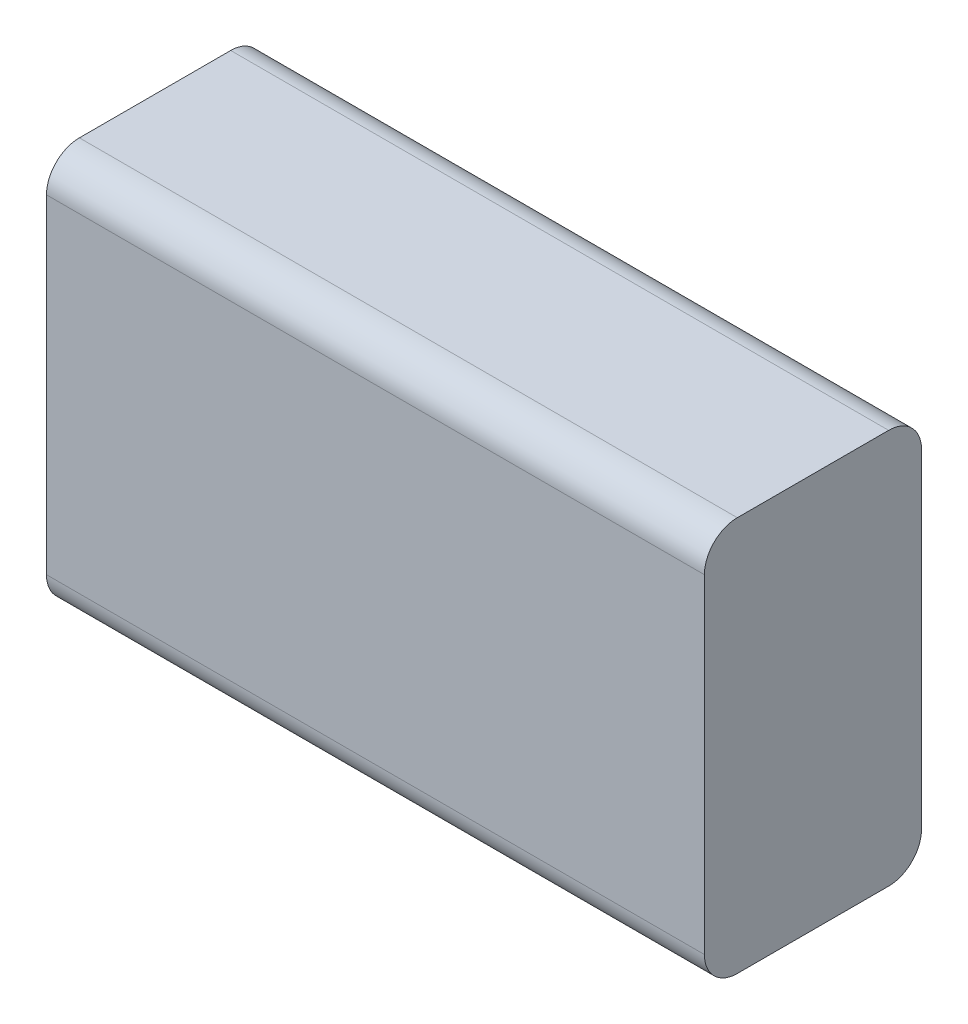
ISO-10303-21;
HEADER;
FILE_DESCRIPTION(('STEP AP214'),'2;1');
FILE_NAME('part.step','',(''),(''),'','','');
FILE_SCHEMA(('AUTOMOTIVE_DESIGN { 1 0 10303 214 1 1 1 1 }'));
ENDSEC;
DATA;
#1=APPLICATION_CONTEXT('core data for automotive mechanical design processes');
#2=APPLICATION_PROTOCOL_DEFINITION('international standard','automotive_design',2000,#1);
#3=PRODUCT_CONTEXT('',#1,'mechanical');
#4=PRODUCT('Part','Part','',(#3));
#5=PRODUCT_RELATED_PRODUCT_CATEGORY('part','',(#4));
#6=PRODUCT_DEFINITION_FORMATION('','',#4);
#7=PRODUCT_DEFINITION_CONTEXT('part definition',#1,'design');
#8=PRODUCT_DEFINITION('design','',#6,#7);
#9=PRODUCT_DEFINITION_SHAPE('','',#8);
#10=(LENGTH_UNIT() NAMED_UNIT(*) SI_UNIT(.MILLI.,.METRE.));
#11=(NAMED_UNIT(*) PLANE_ANGLE_UNIT() SI_UNIT($,.RADIAN.));
#12=(NAMED_UNIT(*) SI_UNIT($,.STERADIAN.) SOLID_ANGLE_UNIT());
#13=UNCERTAINTY_MEASURE_WITH_UNIT(LENGTH_MEASURE(1.E-05),#10,'distance_accuracy_value','');
#14=(GEOMETRIC_REPRESENTATION_CONTEXT(3) GLOBAL_UNCERTAINTY_ASSIGNED_CONTEXT((#13)) GLOBAL_UNIT_ASSIGNED_CONTEXT((#10,
#11,#12)) REPRESENTATION_CONTEXT('',''));
#15=CARTESIAN_POINT('',(0.,0.,0.));
#16=DIRECTION('',(0.,0.,1.));
#17=DIRECTION('',(1.,0.,0.));
#18=AXIS2_PLACEMENT_3D('',#15,#16,#17);
#19=CARTESIAN_POINT('',(0.,0.6,0.));
#20=DIRECTION('',(1.,0.,0.));
#21=DIRECTION('',(0.,0.,-1.));
#22=AXIS2_PLACEMENT_3D('',#19,#20,#21);
#23=PLANE('',#22);
#24=DIRECTION('',(0.,-1.,0.));
#25=VECTOR('',#24,1.);
#26=CARTESIAN_POINT('',(0.,0.6,0.33));
#27=LINE('',#26,#25);
#28=CARTESIAN_POINT('',(0.,0.55,0.33));
#29=VERTEX_POINT('',#28);
#30=CARTESIAN_POINT('',(0.,0.05,0.33));
#31=VERTEX_POINT('',#30);
#32=EDGE_CURVE('E126',#29,#31,#27,.T.);
#33=ORIENTED_EDGE('',*,*,#32,.F.);
#34=CARTESIAN_POINT('',(0.,0.55,0.28));
#35=DIRECTION('',(1.,0.,0.));
#36=DIRECTION('',(0.,0.,-1.));
#37=AXIS2_PLACEMENT_3D('',#34,#35,#36);
#38=CIRCLE('',#37,0.05);
#39=CARTESIAN_POINT('',(0.,0.6,0.28));
#40=VERTEX_POINT('',#39);
#41=EDGE_CURVE('E130',#29,#40,#38,.F.);
#42=ORIENTED_EDGE('',*,*,#41,.T.);
#43=DIRECTION('',(0.,0.,1.));
#44=VECTOR('',#43,1.);
#45=CARTESIAN_POINT('',(0.,0.6,0.));
#46=LINE('',#45,#44);
#47=CARTESIAN_POINT('',(0.,0.6,0.05));
#48=VERTEX_POINT('',#47);
#49=EDGE_CURVE('E120',#48,#40,#46,.T.);
#50=ORIENTED_EDGE('',*,*,#49,.F.);
#51=CARTESIAN_POINT('',(0.,0.55,0.05));
#52=DIRECTION('',(1.,0.,0.));
#53=DIRECTION('',(0.,0.,-1.));
#54=AXIS2_PLACEMENT_3D('',#51,#52,#53);
#55=CIRCLE('',#54,0.05);
#56=CARTESIAN_POINT('',(0.,0.55,0.));
#57=VERTEX_POINT('',#56);
#58=EDGE_CURVE('E65',#48,#57,#55,.F.);
#59=ORIENTED_EDGE('',*,*,#58,.T.);
#60=DIRECTION('',(0.,-1.,0.));
#61=VECTOR('',#60,1.);
#62=CARTESIAN_POINT('',(0.,0.6,0.));
#63=LINE('',#62,#61);
#64=CARTESIAN_POINT('',(0.,0.05,0.));
#65=VERTEX_POINT('',#64);
#66=EDGE_CURVE('E136',#57,#65,#63,.T.);
#67=ORIENTED_EDGE('',*,*,#66,.T.);
#68=CARTESIAN_POINT('',(0.,0.05,0.05));
#69=DIRECTION('',(1.,0.,0.));
#70=DIRECTION('',(0.,0.,-1.));
#71=AXIS2_PLACEMENT_3D('',#68,#69,#70);
#72=CIRCLE('',#71,0.05);
#73=CARTESIAN_POINT('',(0.,0.,0.05));
#74=VERTEX_POINT('',#73);
#75=EDGE_CURVE('E58',#65,#74,#72,.F.);
#76=ORIENTED_EDGE('',*,*,#75,.T.);
#77=DIRECTION('',(0.,0.,1.));
#78=VECTOR('',#77,1.);
#79=CARTESIAN_POINT('',(0.,0.,0.));
#80=LINE('',#79,#78);
#81=CARTESIAN_POINT('',(0.,0.,0.28));
#82=VERTEX_POINT('',#81);
#83=EDGE_CURVE('E139',#74,#82,#80,.T.);
#84=ORIENTED_EDGE('',*,*,#83,.T.);
#85=CARTESIAN_POINT('',(0.,0.05,0.28));
#86=DIRECTION('',(1.,0.,0.));
#87=DIRECTION('',(0.,0.,-1.));
#88=AXIS2_PLACEMENT_3D('',#85,#86,#87);
#89=CIRCLE('',#88,0.05);
#90=EDGE_CURVE('E180',#82,#31,#89,.F.);
#91=ORIENTED_EDGE('',*,*,#90,.T.);
#92=EDGE_LOOP('',(#33,#42,#50,#59,#67,#76,#84,#91));
#93=FACE_BOUND('',#92,.T.);
#94=ADVANCED_FACE('F42',(#93),#23,.F.);
#95=CARTESIAN_POINT('',(0.,0.6,0.33));
#96=DIRECTION('',(0.,0.,-1.));
#97=DIRECTION('',(-1.,0.,0.));
#98=AXIS2_PLACEMENT_3D('',#95,#96,#97);
#99=PLANE('',#98);
#100=DIRECTION('',(0.,-1.,0.));
#101=VECTOR('',#100,1.);
#102=CARTESIAN_POINT('',(1.,0.6,0.33));
#103=LINE('',#102,#101);
#104=CARTESIAN_POINT('',(1.,0.55,0.33));
#105=VERTEX_POINT('',#104);
#106=CARTESIAN_POINT('',(1.,0.05,0.33));
#107=VERTEX_POINT('',#106);
#108=EDGE_CURVE('E151',#105,#107,#103,.T.);
#109=ORIENTED_EDGE('',*,*,#108,.F.);
#110=DIRECTION('',(1.,0.,0.));
#111=VECTOR('',#110,1.);
#112=CARTESIAN_POINT('',(0.,0.55,0.33));
#113=LINE('',#112,#111);
#114=EDGE_CURVE('E113',#105,#29,#113,.F.);
#115=ORIENTED_EDGE('',*,*,#114,.T.);
#116=ORIENTED_EDGE('',*,*,#32,.T.);
#117=DIRECTION('',(1.,0.,0.));
#118=VECTOR('',#117,1.);
#119=CARTESIAN_POINT('',(0.,0.05,0.33));
#120=LINE('',#119,#118);
#121=EDGE_CURVE('E172',#31,#107,#120,.T.);
#122=ORIENTED_EDGE('',*,*,#121,.T.);
#123=EDGE_LOOP('',(#109,#115,#116,#122));
#124=FACE_BOUND('',#123,.T.);
#125=ADVANCED_FACE('F209',(#124),#99,.F.);
#126=CARTESIAN_POINT('',(1.,0.6,0.));
#127=DIRECTION('',(-1.,0.,0.));
#128=DIRECTION('',(0.,0.,1.));
#129=AXIS2_PLACEMENT_3D('',#126,#127,#128);
#130=PLANE('',#129);
#131=DIRECTION('',(0.,0.,-1.));
#132=VECTOR('',#131,1.);
#133=CARTESIAN_POINT('',(1.,0.6,0.));
#134=LINE('',#133,#132);
#135=CARTESIAN_POINT('',(1.,0.6,0.28));
#136=VERTEX_POINT('',#135);
#137=CARTESIAN_POINT('',(1.,0.6,0.05));
#138=VERTEX_POINT('',#137);
#139=EDGE_CURVE('E123',#136,#138,#134,.T.);
#140=ORIENTED_EDGE('',*,*,#139,.F.);
#141=CARTESIAN_POINT('',(1.,0.55,0.28));
#142=DIRECTION('',(-1.,0.,0.));
#143=DIRECTION('',(0.,0.,1.));
#144=AXIS2_PLACEMENT_3D('',#141,#142,#143);
#145=CIRCLE('',#144,0.05);
#146=EDGE_CURVE('E169',#136,#105,#145,.F.);
#147=ORIENTED_EDGE('',*,*,#146,.T.);
#148=ORIENTED_EDGE('',*,*,#108,.T.);
#149=CARTESIAN_POINT('',(1.,0.05,0.28));
#150=DIRECTION('',(-1.,0.,0.));
#151=DIRECTION('',(0.,0.,1.));
#152=AXIS2_PLACEMENT_3D('',#149,#150,#151);
#153=CIRCLE('',#152,0.05);
#154=CARTESIAN_POINT('',(1.,0.,0.28));
#155=VERTEX_POINT('',#154);
#156=EDGE_CURVE('E166',#107,#155,#153,.F.);
#157=ORIENTED_EDGE('',*,*,#156,.T.);
#158=DIRECTION('',(0.,0.,-1.));
#159=VECTOR('',#158,1.);
#160=CARTESIAN_POINT('',(1.,0.,0.));
#161=LINE('',#160,#159);
#162=CARTESIAN_POINT('',(1.,0.,0.05));
#163=VERTEX_POINT('',#162);
#164=EDGE_CURVE('E132',#155,#163,#161,.T.);
#165=ORIENTED_EDGE('',*,*,#164,.T.);
#166=CARTESIAN_POINT('',(1.,0.05,0.05));
#167=DIRECTION('',(-1.,0.,0.));
#168=DIRECTION('',(0.,0.,1.));
#169=AXIS2_PLACEMENT_3D('',#166,#167,#168);
#170=CIRCLE('',#169,0.05);
#171=CARTESIAN_POINT('',(1.,0.05,0.));
#172=VERTEX_POINT('',#171);
#173=EDGE_CURVE('E163',#163,#172,#170,.F.);
#174=ORIENTED_EDGE('',*,*,#173,.T.);
#175=DIRECTION('',(0.,-1.,0.));
#176=VECTOR('',#175,1.);
#177=CARTESIAN_POINT('',(1.,0.6,0.));
#178=LINE('',#177,#176);
#179=CARTESIAN_POINT('',(1.,0.55,0.));
#180=VERTEX_POINT('',#179);
#181=EDGE_CURVE('E147',#180,#172,#178,.T.);
#182=ORIENTED_EDGE('',*,*,#181,.F.);
#183=CARTESIAN_POINT('',(1.,0.55,0.05));
#184=DIRECTION('',(-1.,0.,0.));
#185=DIRECTION('',(0.,0.,1.));
#186=AXIS2_PLACEMENT_3D('',#183,#184,#185);
#187=CIRCLE('',#186,0.05);
#188=EDGE_CURVE('E160',#180,#138,#187,.F.);
#189=ORIENTED_EDGE('',*,*,#188,.T.);
#190=EDGE_LOOP('',(#140,#147,#148,#157,#165,#174,#182,#189));
#191=FACE_BOUND('',#190,.T.);
#192=ADVANCED_FACE('F195',(#191),#130,.F.);
#193=CARTESIAN_POINT('',(0.,0.6,0.));
#194=DIRECTION('',(0.,0.,1.));
#195=DIRECTION('',(1.,0.,0.));
#196=AXIS2_PLACEMENT_3D('',#193,#194,#195);
#197=PLANE('',#196);
#198=ORIENTED_EDGE('',*,*,#181,.T.);
#199=DIRECTION('',(-1.,0.,0.));
#200=VECTOR('',#199,1.);
#201=CARTESIAN_POINT('',(0.,0.05,0.));
#202=LINE('',#201,#200);
#203=EDGE_CURVE('E11',#172,#65,#202,.T.);
#204=ORIENTED_EDGE('',*,*,#203,.T.);
#205=ORIENTED_EDGE('',*,*,#66,.F.);
#206=DIRECTION('',(-1.,0.,0.));
#207=VECTOR('',#206,1.);
#208=CARTESIAN_POINT('',(1.,0.55,0.));
#209=LINE('',#208,#207);
#210=EDGE_CURVE('E51',#57,#180,#209,.F.);
#211=ORIENTED_EDGE('',*,*,#210,.T.);
#212=EDGE_LOOP('',(#198,#204,#205,#211));
#213=FACE_BOUND('',#212,.T.);
#214=ADVANCED_FACE('F193',(#213),#197,.F.);
#215=CARTESIAN_POINT('',(0.,0.6,0.));
#216=DIRECTION('',(0.,1.,0.));
#217=DIRECTION('',(0.,0.,1.));
#218=AXIS2_PLACEMENT_3D('',#215,#216,#217);
#219=PLANE('',#218);
#220=ORIENTED_EDGE('',*,*,#49,.T.);
#221=DIRECTION('',(1.,0.,0.));
#222=VECTOR('',#221,1.);
#223=CARTESIAN_POINT('',(1.,0.6,0.28));
#224=LINE('',#223,#222);
#225=EDGE_CURVE('E125',#40,#136,#224,.T.);
#226=ORIENTED_EDGE('',*,*,#225,.T.);
#227=ORIENTED_EDGE('',*,*,#139,.T.);
#228=DIRECTION('',(-1.,0.,0.));
#229=VECTOR('',#228,1.);
#230=CARTESIAN_POINT('',(0.,0.6,0.05));
#231=LINE('',#230,#229);
#232=EDGE_CURVE('E111',#138,#48,#231,.T.);
#233=ORIENTED_EDGE('',*,*,#232,.T.);
#234=EDGE_LOOP('',(#220,#226,#227,#233));
#235=FACE_BOUND('',#234,.T.);
#236=ADVANCED_FACE('F118',(#235),#219,.T.);
#237=CARTESIAN_POINT('',(0.,0.,0.));
#238=DIRECTION('',(0.,1.,0.));
#239=DIRECTION('',(0.,0.,1.));
#240=AXIS2_PLACEMENT_3D('',#237,#238,#239);
#241=PLANE('',#240);
#242=ORIENTED_EDGE('',*,*,#164,.F.);
#243=DIRECTION('',(1.,0.,0.));
#244=VECTOR('',#243,1.);
#245=CARTESIAN_POINT('',(0.,0.,0.28));
#246=LINE('',#245,#244);
#247=EDGE_CURVE('E188',#155,#82,#246,.F.);
#248=ORIENTED_EDGE('',*,*,#247,.T.);
#249=ORIENTED_EDGE('',*,*,#83,.F.);
#250=DIRECTION('',(-1.,0.,0.));
#251=VECTOR('',#250,1.);
#252=CARTESIAN_POINT('',(0.,0.,0.05));
#253=LINE('',#252,#251);
#254=EDGE_CURVE('E185',#74,#163,#253,.F.);
#255=ORIENTED_EDGE('',*,*,#254,.T.);
#256=EDGE_LOOP('',(#242,#248,#249,#255));
#257=FACE_BOUND('',#256,.T.);
#258=ADVANCED_FACE('F202',(#257),#241,.F.);
#259=CARTESIAN_POINT('',(0.,0.55,0.28));
#260=DIRECTION('',(-1.,0.,0.));
#261=DIRECTION('',(0.,0.,1.));
#262=AXIS2_PLACEMENT_3D('',#259,#260,#261);
#263=CYLINDRICAL_SURFACE('',#262,0.05);
#264=ORIENTED_EDGE('',*,*,#41,.F.);
#265=ORIENTED_EDGE('',*,*,#114,.F.);
#266=ORIENTED_EDGE('',*,*,#146,.F.);
#267=ORIENTED_EDGE('',*,*,#225,.F.);
#268=EDGE_LOOP('',(#264,#265,#266,#267));
#269=FACE_BOUND('',#268,.T.);
#270=ADVANCED_FACE('F212',(#269),#263,.T.);
#271=CARTESIAN_POINT('',(0.,0.05,0.28));
#272=DIRECTION('',(1.,0.,0.));
#273=DIRECTION('',(0.,0.,-1.));
#274=AXIS2_PLACEMENT_3D('',#271,#272,#273);
#275=CYLINDRICAL_SURFACE('',#274,0.05);
#276=ORIENTED_EDGE('',*,*,#90,.F.);
#277=ORIENTED_EDGE('',*,*,#247,.F.);
#278=ORIENTED_EDGE('',*,*,#156,.F.);
#279=ORIENTED_EDGE('',*,*,#121,.F.);
#280=EDGE_LOOP('',(#276,#277,#278,#279));
#281=FACE_BOUND('',#280,.T.);
#282=ADVANCED_FACE('F205',(#281),#275,.T.);
#283=CARTESIAN_POINT('',(0.,0.05,0.05));
#284=DIRECTION('',(-1.,0.,0.));
#285=DIRECTION('',(0.,0.,1.));
#286=AXIS2_PLACEMENT_3D('',#283,#284,#285);
#287=CYLINDRICAL_SURFACE('',#286,0.05);
#288=ORIENTED_EDGE('',*,*,#173,.F.);
#289=ORIENTED_EDGE('',*,*,#254,.F.);
#290=ORIENTED_EDGE('',*,*,#75,.F.);
#291=ORIENTED_EDGE('',*,*,#203,.F.);
#292=EDGE_LOOP('',(#288,#289,#290,#291));
#293=FACE_BOUND('',#292,.T.);
#294=ADVANCED_FACE('F198',(#293),#287,.T.);
#295=CARTESIAN_POINT('',(0.,0.55,0.05));
#296=DIRECTION('',(1.,0.,0.));
#297=DIRECTION('',(0.,0.,-1.));
#298=AXIS2_PLACEMENT_3D('',#295,#296,#297);
#299=CYLINDRICAL_SURFACE('',#298,0.05);
#300=ORIENTED_EDGE('',*,*,#188,.F.);
#301=ORIENTED_EDGE('',*,*,#210,.F.);
#302=ORIENTED_EDGE('',*,*,#58,.F.);
#303=ORIENTED_EDGE('',*,*,#232,.F.);
#304=EDGE_LOOP('',(#300,#301,#302,#303));
#305=FACE_BOUND('',#304,.T.);
#306=ADVANCED_FACE('F44',(#305),#299,.T.);
#307=CLOSED_SHELL('',(#94,#125,#192,#214,#236,#258,#270,#282,#294,#306));
#308=MANIFOLD_SOLID_BREP('B2',#307);
#309=ADVANCED_BREP_SHAPE_REPRESENTATION('',(#18,#308),#14);
#310=SHAPE_DEFINITION_REPRESENTATION(#9,#309);
ENDSEC;
END-ISO-10303-21;
